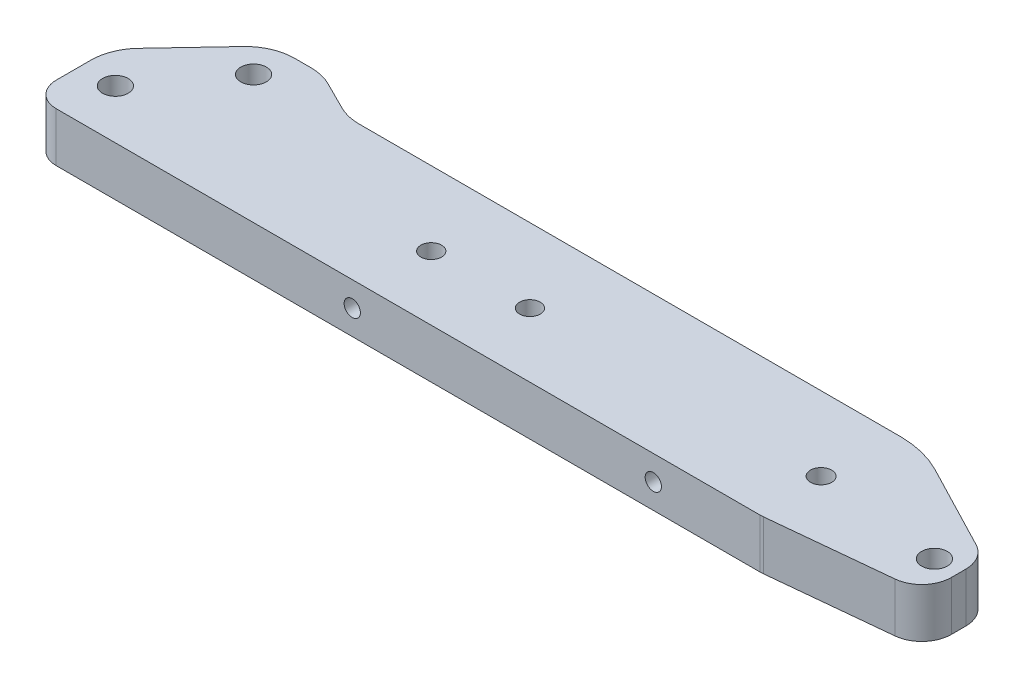
ISO-10303-21;
HEADER;
FILE_DESCRIPTION(('STEP AP214'),'2;1');
FILE_NAME('part.step','',(''),(''),'','','');
FILE_SCHEMA(('AUTOMOTIVE_DESIGN { 1 0 10303 214 1 1 1 1 }'));
ENDSEC;
DATA;
#1=APPLICATION_CONTEXT('core data for automotive mechanical design processes');
#2=APPLICATION_PROTOCOL_DEFINITION('international standard','automotive_design',2000,#1);
#3=PRODUCT_CONTEXT('',#1,'mechanical');
#4=PRODUCT('Part','Part','',(#3));
#5=PRODUCT_RELATED_PRODUCT_CATEGORY('part','',(#4));
#6=PRODUCT_DEFINITION_FORMATION('','',#4);
#7=PRODUCT_DEFINITION_CONTEXT('part definition',#1,'design');
#8=PRODUCT_DEFINITION('design','',#6,#7);
#9=PRODUCT_DEFINITION_SHAPE('','',#8);
#10=(LENGTH_UNIT() NAMED_UNIT(*) SI_UNIT(.MILLI.,.METRE.));
#11=(NAMED_UNIT(*) PLANE_ANGLE_UNIT() SI_UNIT($,.RADIAN.));
#12=(NAMED_UNIT(*) SI_UNIT($,.STERADIAN.) SOLID_ANGLE_UNIT());
#13=UNCERTAINTY_MEASURE_WITH_UNIT(LENGTH_MEASURE(1.E-05),#10,'distance_accuracy_value','');
#14=(GEOMETRIC_REPRESENTATION_CONTEXT(3) GLOBAL_UNCERTAINTY_ASSIGNED_CONTEXT((#13)) GLOBAL_UNIT_ASSIGNED_CONTEXT((#10,
#11,#12)) REPRESENTATION_CONTEXT('',''));
#15=CARTESIAN_POINT('',(0.,0.,0.));
#16=DIRECTION('',(0.,0.,1.));
#17=DIRECTION('',(1.,0.,0.));
#18=AXIS2_PLACEMENT_3D('',#15,#16,#17);
#19=CARTESIAN_POINT('',(0.,10.,0.));
#20=DIRECTION('',(0.,1.,0.));
#21=DIRECTION('',(0.,0.,1.));
#22=AXIS2_PLACEMENT_3D('',#19,#20,#21);
#23=PLANE('',#22);
#24=CARTESIAN_POINT('',(50.,10.,-13.));
#25=DIRECTION('',(0.,1.,0.));
#26=DIRECTION('',(0.,0.,1.));
#27=AXIS2_PLACEMENT_3D('',#24,#25,#26);
#28=CIRCLE('',#27,2.1);
#29=CARTESIAN_POINT('',(50.,10.,-10.9));
#30=VERTEX_POINT('',#29);
#31=EDGE_CURVE('E372',#30,#30,#28,.T.);
#32=ORIENTED_EDGE('',*,*,#31,.F.);
#33=EDGE_LOOP('',(#32));
#34=FACE_BOUND('',#33,.T.);
#35=CARTESIAN_POINT('',(129.,10.,-13.));
#36=DIRECTION('',(0.,1.,0.));
#37=DIRECTION('',(0.,0.,1.));
#38=AXIS2_PLACEMENT_3D('',#35,#36,#37);
#39=CIRCLE('',#38,2.15000000000002);
#40=CARTESIAN_POINT('',(129.,10.,-10.85));
#41=VERTEX_POINT('',#40);
#42=EDGE_CURVE('E360',#41,#41,#39,.T.);
#43=ORIENTED_EDGE('',*,*,#42,.F.);
#44=EDGE_LOOP('',(#43));
#45=FACE_BOUND('',#44,.T.);
#46=CARTESIAN_POINT('',(154.9653800056,10.,-10.));
#47=DIRECTION('',(0.,1.,0.));
#48=DIRECTION('',(0.,0.,1.));
#49=AXIS2_PLACEMENT_3D('',#46,#47,#48);
#50=CIRCLE('',#49,2.59999999999999);
#51=CARTESIAN_POINT('',(154.9653800056,10.,-7.40000000000001));
#52=VERTEX_POINT('',#51);
#53=EDGE_CURVE('E305',#52,#52,#50,.T.);
#54=ORIENTED_EDGE('',*,*,#53,.F.);
#55=EDGE_LOOP('',(#54));
#56=FACE_BOUND('',#55,.T.);
#57=DIRECTION('',(-0.894427190999916,0.,-0.447213595499958));
#58=VECTOR('',#57,1.);
#59=CARTESIAN_POINT('',(8.,10.,-33.));
#60=LINE('',#59,#58);
#61=CARTESIAN_POINT('',(15.8885438199983,10.,-29.0557280900008));
#62=VERTEX_POINT('',#61);
#63=CARTESIAN_POINT('',(10.1114561800017,10.,-31.9442719099992));
#64=VERTEX_POINT('',#63);
#65=EDGE_CURVE('E286',#62,#64,#60,.T.);
#66=ORIENTED_EDGE('',*,*,#65,.T.);
#67=CARTESIAN_POINT('',(5.6393202250021,10.,-23.));
#68=DIRECTION('',(0.,1.,0.));
#69=DIRECTION('',(0.,0.,1.));
#70=AXIS2_PLACEMENT_3D('',#67,#68,#69);
#71=CIRCLE('',#70,10.);
#72=CARTESIAN_POINT('',(5.6393202250021,10.,-33.));
#73=VERTEX_POINT('',#72);
#74=EDGE_CURVE('E52',#64,#73,#71,.T.);
#75=ORIENTED_EDGE('',*,*,#74,.T.);
#76=DIRECTION('',(-1.,0.,0.));
#77=VECTOR('',#76,1.);
#78=CARTESIAN_POINT('',(-2.,10.,-33.));
#79=LINE('',#78,#77);
#80=CARTESIAN_POINT('',(2.32072650579852,10.,-33.));
#81=VERTEX_POINT('',#80);
#82=EDGE_CURVE('E290',#73,#81,#79,.T.);
#83=ORIENTED_EDGE('',*,*,#82,.T.);
#84=CARTESIAN_POINT('',(2.32072650579852,10.,-23.));
#85=DIRECTION('',(0.,1.,0.));
#86=DIRECTION('',(0.,0.,1.));
#87=AXIS2_PLACEMENT_3D('',#84,#85,#86);
#88=CIRCLE('',#87,10.);
#89=CARTESIAN_POINT('',(-4.9612734211295,10.,-29.8536469900499));
#90=VERTEX_POINT('',#89);
#91=EDGE_CURVE('E242',#81,#90,#88,.T.);
#92=ORIENTED_EDGE('',*,*,#91,.T.);
#93=DIRECTION('',(-0.685364699004991,0.,0.728199992692803));
#94=VECTOR('',#93,1.);
#95=CARTESIAN_POINT('',(-18.,10.,-16.));
#96=LINE('',#95,#94);
#97=CARTESIAN_POINT('',(-15.281999926928,10.,-18.887875077639));
#98=VERTEX_POINT('',#97);
#99=EDGE_CURVE('E292',#90,#98,#96,.T.);
#100=ORIENTED_EDGE('',*,*,#99,.T.);
#101=CARTESIAN_POINT('',(-8.,10.,-12.0342280875891));
#102=DIRECTION('',(0.,1.,0.));
#103=DIRECTION('',(0.,0.,1.));
#104=AXIS2_PLACEMENT_3D('',#101,#102,#103);
#105=CIRCLE('',#104,10.);
#106=CARTESIAN_POINT('',(-18.,10.,-12.0342280875891));
#107=VERTEX_POINT('',#106);
#108=EDGE_CURVE('E240',#98,#107,#105,.T.);
#109=ORIENTED_EDGE('',*,*,#108,.T.);
#110=DIRECTION('',(0.,0.,1.));
#111=VECTOR('',#110,1.);
#112=CARTESIAN_POINT('',(-18.,10.,-16.));
#113=LINE('',#112,#111);
#114=CARTESIAN_POINT('',(-18.,10.,-5.));
#115=VERTEX_POINT('',#114);
#116=EDGE_CURVE('E183',#107,#115,#113,.T.);
#117=ORIENTED_EDGE('',*,*,#116,.T.);
#118=CARTESIAN_POINT('',(-13.,10.,-5.));
#119=DIRECTION('',(0.,1.,0.));
#120=DIRECTION('',(0.,0.,1.));
#121=AXIS2_PLACEMENT_3D('',#118,#119,#120);
#122=CIRCLE('',#121,5.);
#123=CARTESIAN_POINT('',(-13.,10.,0.));
#124=VERTEX_POINT('',#123);
#125=EDGE_CURVE('E199',#115,#124,#122,.T.);
#126=ORIENTED_EDGE('',*,*,#125,.T.);
#127=DIRECTION('',(1.,0.,0.));
#128=VECTOR('',#127,1.);
#129=CARTESIAN_POINT('',(0.,10.,0.));
#130=LINE('',#129,#128);
#131=CARTESIAN_POINT('',(129.666126278875,10.,0.));
#132=VERTEX_POINT('',#131);
#133=EDGE_CURVE('E182',#124,#132,#130,.T.);
#134=ORIENTED_EDGE('',*,*,#133,.T.);
#135=CARTESIAN_POINT('',(129.666126278875,10.,-6.));
#136=DIRECTION('',(0.,1.,0.));
#137=DIRECTION('',(0.,0.,1.));
#138=AXIS2_PLACEMENT_3D('',#135,#136,#137);
#139=CIRCLE('',#138,6.);
#140=CARTESIAN_POINT('',(130.263148593001,10.,-0.0297768587400656));
#141=VERTEX_POINT('',#140);
#142=EDGE_CURVE('E217',#132,#141,#139,.T.);
#143=ORIENTED_EDGE('',*,*,#142,.T.);
#144=DIRECTION('',(0.995037190209989,0.,-0.0995037190209989));
#145=VECTOR('',#144,1.);
#146=CARTESIAN_POINT('',(159.9653800056,10.,-3.));
#147=LINE('',#146,#145);
#148=CARTESIAN_POINT('',(154.562402319726,10.,-2.4597022314126));
#149=VERTEX_POINT('',#148);
#150=EDGE_CURVE('E192',#141,#149,#147,.T.);
#151=ORIENTED_EDGE('',*,*,#150,.T.);
#152=CARTESIAN_POINT('',(153.9653800056,10.,-8.42992537267253));
#153=DIRECTION('',(0.,1.,0.));
#154=DIRECTION('',(0.,0.,1.));
#155=AXIS2_PLACEMENT_3D('',#152,#153,#154);
#156=CIRCLE('',#155,6.);
#157=CARTESIAN_POINT('',(159.9653800056,10.,-8.42992537267253));
#158=VERTEX_POINT('',#157);
#159=EDGE_CURVE('E215',#149,#158,#156,.T.);
#160=ORIENTED_EDGE('',*,*,#159,.T.);
#161=DIRECTION('',(0.,0.,-1.));
#162=VECTOR('',#161,1.);
#163=CARTESIAN_POINT('',(159.9653800056,10.,-3.));
#164=LINE('',#163,#162);
#165=CARTESIAN_POINT('',(159.9653800056,10.,-11.3572786542694));
#166=VERTEX_POINT('',#165);
#167=EDGE_CURVE('E345',#158,#166,#164,.T.);
#168=ORIENTED_EDGE('',*,*,#167,.T.);
#169=CARTESIAN_POINT('',(153.9653800056,10.,-11.3572786542694));
#170=DIRECTION('',(0.,1.,0.));
#171=DIRECTION('',(0.,0.,1.));
#172=AXIS2_PLACEMENT_3D('',#169,#170,#171);
#173=CIRCLE('',#172,6.);
#174=CARTESIAN_POINT('',(156.733496425452,10.,-16.680579461677));
#175=VERTEX_POINT('',#174);
#176=EDGE_CURVE('E213',#166,#175,#173,.T.);
#177=ORIENTED_EDGE('',*,*,#176,.T.);
#178=DIRECTION('',(-0.887216801234595,0.,-0.46135273664199));
#179=VECTOR('',#178,1.);
#180=CARTESIAN_POINT('',(159.9653800056,10.,-15.));
#181=LINE('',#180,#179);
#182=CARTESIAN_POINT('',(139.303195342731,10.,-25.7443360246919));
#183=VERTEX_POINT('',#182);
#184=EDGE_CURVE('E294',#175,#183,#181,.T.);
#185=ORIENTED_EDGE('',*,*,#184,.T.);
#186=CARTESIAN_POINT('',(130.076140609891,10.,-8.));
#187=DIRECTION('',(0.,1.,0.));
#188=DIRECTION('',(0.,0.,1.));
#189=AXIS2_PLACEMENT_3D('',#186,#187,#188);
#190=CIRCLE('',#189,20.);
#191=CARTESIAN_POINT('',(130.076140609891,10.,-28.));
#192=VERTEX_POINT('',#191);
#193=EDGE_CURVE('E254',#183,#192,#190,.T.);
#194=ORIENTED_EDGE('',*,*,#193,.T.);
#195=DIRECTION('',(-1.,0.,0.));
#196=VECTOR('',#195,1.);
#197=CARTESIAN_POINT('',(18.,10.,-28.));
#198=LINE('',#197,#196);
#199=CARTESIAN_POINT('',(20.3606797749979,10.,-28.));
#200=VERTEX_POINT('',#199);
#201=EDGE_CURVE('E287',#192,#200,#198,.T.);
#202=ORIENTED_EDGE('',*,*,#201,.T.);
#203=CARTESIAN_POINT('',(20.3606797749979,10.,-38.));
#204=DIRECTION('',(0.,1.,0.));
#205=DIRECTION('',(0.,0.,1.));
#206=AXIS2_PLACEMENT_3D('',#203,#204,#205);
#207=CIRCLE('',#206,10.);
#208=EDGE_CURVE('E11',#200,#62,#207,.F.);
#209=ORIENTED_EDGE('',*,*,#208,.T.);
#210=EDGE_LOOP('',(#66,#75,#83,#92,#100,#109,#117,#126,#134,#143,#151,#160,#168,#177,#185,#194,
#202,#209));
#211=FACE_BOUND('',#210,.T.);
#212=CARTESIAN_POINT('',(-11.,10.,-10.));
#213=DIRECTION('',(0.,1.,0.));
#214=DIRECTION('',(0.,0.,1.));
#215=AXIS2_PLACEMENT_3D('',#212,#213,#214);
#216=CIRCLE('',#215,2.6);
#217=CARTESIAN_POINT('',(-11.,10.,-7.4));
#218=VERTEX_POINT('',#217);
#219=EDGE_CURVE('E354',#218,#218,#216,.T.);
#220=ORIENTED_EDGE('',*,*,#219,.F.);
#221=EDGE_LOOP('',(#220));
#222=FACE_BOUND('',#221,.T.);
#223=CARTESIAN_POINT('',(0.999999999999992,10.,-26.));
#224=DIRECTION('',(0.,1.,0.));
#225=DIRECTION('',(0.,0.,1.));
#226=AXIS2_PLACEMENT_3D('',#223,#224,#225);
#227=CIRCLE('',#226,2.6);
#228=CARTESIAN_POINT('',(0.999999999999992,10.,-23.4));
#229=VERTEX_POINT('',#228);
#230=EDGE_CURVE('E366',#229,#229,#227,.T.);
#231=ORIENTED_EDGE('',*,*,#230,.F.);
#232=EDGE_LOOP('',(#231));
#233=FACE_BOUND('',#232,.T.);
#234=CARTESIAN_POINT('',(70.,10.,-13.));
#235=DIRECTION('',(0.,1.,0.));
#236=DIRECTION('',(0.,0.,1.));
#237=AXIS2_PLACEMENT_3D('',#234,#235,#236);
#238=CIRCLE('',#237,2.1);
#239=CARTESIAN_POINT('',(70.,10.,-10.9));
#240=VERTEX_POINT('',#239);
#241=EDGE_CURVE('E378',#240,#240,#238,.T.);
#242=ORIENTED_EDGE('',*,*,#241,.F.);
#243=EDGE_LOOP('',(#242));
#244=FACE_BOUND('',#243,.T.);
#245=ADVANCED_FACE('F37',(#34,#45,#56,#211,#222,#233,#244),#23,.T.);
#246=CARTESIAN_POINT('',(0.,0.,0.));
#247=DIRECTION('',(0.,1.,0.));
#248=DIRECTION('',(0.,0.,1.));
#249=AXIS2_PLACEMENT_3D('',#246,#247,#248);
#250=PLANE('',#249);
#251=DIRECTION('',(-1.,0.,0.));
#252=VECTOR('',#251,1.);
#253=CARTESIAN_POINT('',(-2.,0.,-33.));
#254=LINE('',#253,#252);
#255=CARTESIAN_POINT('',(5.6393202250021,0.,-33.));
#256=VERTEX_POINT('',#255);
#257=CARTESIAN_POINT('',(2.32072650579852,0.,-33.));
#258=VERTEX_POINT('',#257);
#259=EDGE_CURVE('E311',#256,#258,#254,.T.);
#260=ORIENTED_EDGE('',*,*,#259,.F.);
#261=CARTESIAN_POINT('',(5.6393202250021,0.,-23.));
#262=DIRECTION('',(0.,1.,0.));
#263=DIRECTION('',(0.,0.,1.));
#264=AXIS2_PLACEMENT_3D('',#261,#262,#263);
#265=CIRCLE('',#264,10.);
#266=CARTESIAN_POINT('',(10.1114561800017,0.,-31.9442719099992));
#267=VERTEX_POINT('',#266);
#268=EDGE_CURVE('E60',#256,#267,#265,.F.);
#269=ORIENTED_EDGE('',*,*,#268,.T.);
#270=DIRECTION('',(-0.894427190999916,0.,-0.447213595499958));
#271=VECTOR('',#270,1.);
#272=CARTESIAN_POINT('',(8.,0.,-33.));
#273=LINE('',#272,#271);
#274=CARTESIAN_POINT('',(15.8885438199983,0.,-29.0557280900008));
#275=VERTEX_POINT('',#274);
#276=EDGE_CURVE('E271',#275,#267,#273,.T.);
#277=ORIENTED_EDGE('',*,*,#276,.F.);
#278=CARTESIAN_POINT('',(20.3606797749979,0.,-38.));
#279=DIRECTION('',(0.,1.,0.));
#280=DIRECTION('',(0.,0.,1.));
#281=AXIS2_PLACEMENT_3D('',#278,#279,#280);
#282=CIRCLE('',#281,10.);
#283=CARTESIAN_POINT('',(20.3606797749979,0.,-28.));
#284=VERTEX_POINT('',#283);
#285=EDGE_CURVE('E45',#275,#284,#282,.T.);
#286=ORIENTED_EDGE('',*,*,#285,.T.);
#287=DIRECTION('',(-1.,0.,0.));
#288=VECTOR('',#287,1.);
#289=CARTESIAN_POINT('',(18.,0.,-28.));
#290=LINE('',#289,#288);
#291=CARTESIAN_POINT('',(130.076140609891,0.,-28.));
#292=VERTEX_POINT('',#291);
#293=EDGE_CURVE('E269',#292,#284,#290,.T.);
#294=ORIENTED_EDGE('',*,*,#293,.F.);
#295=CARTESIAN_POINT('',(130.076140609891,0.,-8.));
#296=DIRECTION('',(0.,1.,0.));
#297=DIRECTION('',(0.,0.,1.));
#298=AXIS2_PLACEMENT_3D('',#295,#296,#297);
#299=CIRCLE('',#298,20.);
#300=CARTESIAN_POINT('',(139.303195342731,0.,-25.7443360246919));
#301=VERTEX_POINT('',#300);
#302=EDGE_CURVE('E250',#292,#301,#299,.F.);
#303=ORIENTED_EDGE('',*,*,#302,.T.);
#304=DIRECTION('',(-0.887216801234595,0.,-0.46135273664199));
#305=VECTOR('',#304,1.);
#306=CARTESIAN_POINT('',(159.9653800056,0.,-15.));
#307=LINE('',#306,#305);
#308=CARTESIAN_POINT('',(156.733496425452,0.,-16.680579461677));
#309=VERTEX_POINT('',#308);
#310=EDGE_CURVE('E280',#309,#301,#307,.T.);
#311=ORIENTED_EDGE('',*,*,#310,.F.);
#312=CARTESIAN_POINT('',(153.9653800056,0.,-11.3572786542694));
#313=DIRECTION('',(0.,1.,0.));
#314=DIRECTION('',(0.,0.,1.));
#315=AXIS2_PLACEMENT_3D('',#312,#313,#314);
#316=CIRCLE('',#315,6.);
#317=CARTESIAN_POINT('',(159.9653800056,0.,-11.3572786542694));
#318=VERTEX_POINT('',#317);
#319=EDGE_CURVE('E206',#309,#318,#316,.F.);
#320=ORIENTED_EDGE('',*,*,#319,.T.);
#321=DIRECTION('',(0.,0.,-1.));
#322=VECTOR('',#321,1.);
#323=CARTESIAN_POINT('',(159.9653800056,0.,-3.));
#324=LINE('',#323,#322);
#325=CARTESIAN_POINT('',(159.9653800056,0.,-8.42992537267253));
#326=VERTEX_POINT('',#325);
#327=EDGE_CURVE('E304',#326,#318,#324,.T.);
#328=ORIENTED_EDGE('',*,*,#327,.F.);
#329=CARTESIAN_POINT('',(153.9653800056,0.,-8.42992537267253));
#330=DIRECTION('',(0.,1.,0.));
#331=DIRECTION('',(0.,0.,1.));
#332=AXIS2_PLACEMENT_3D('',#329,#330,#331);
#333=CIRCLE('',#332,6.);
#334=CARTESIAN_POINT('',(154.562402319726,0.,-2.4597022314126));
#335=VERTEX_POINT('',#334);
#336=EDGE_CURVE('E208',#326,#335,#333,.F.);
#337=ORIENTED_EDGE('',*,*,#336,.T.);
#338=DIRECTION('',(0.995037190209989,0.,-0.0995037190209989));
#339=VECTOR('',#338,1.);
#340=CARTESIAN_POINT('',(159.9653800056,0.,-3.));
#341=LINE('',#340,#339);
#342=CARTESIAN_POINT('',(130.263148593001,0.,-0.0297768587400656));
#343=VERTEX_POINT('',#342);
#344=EDGE_CURVE('E301',#343,#335,#341,.T.);
#345=ORIENTED_EDGE('',*,*,#344,.F.);
#346=CARTESIAN_POINT('',(129.666126278875,0.,-6.));
#347=DIRECTION('',(0.,1.,0.));
#348=DIRECTION('',(0.,0.,1.));
#349=AXIS2_PLACEMENT_3D('',#346,#347,#348);
#350=CIRCLE('',#349,6.);
#351=CARTESIAN_POINT('',(129.666126278875,0.,0.));
#352=VERTEX_POINT('',#351);
#353=EDGE_CURVE('E189',#343,#352,#350,.F.);
#354=ORIENTED_EDGE('',*,*,#353,.T.);
#355=DIRECTION('',(1.,0.,0.));
#356=VECTOR('',#355,1.);
#357=CARTESIAN_POINT('',(-18.,0.,0.));
#358=LINE('',#357,#356);
#359=CARTESIAN_POINT('',(-13.,0.,0.));
#360=VERTEX_POINT('',#359);
#361=EDGE_CURVE('E179',#360,#352,#358,.T.);
#362=ORIENTED_EDGE('',*,*,#361,.F.);
#363=CARTESIAN_POINT('',(-13.,0.,-5.));
#364=DIRECTION('',(0.,1.,0.));
#365=DIRECTION('',(0.,0.,1.));
#366=AXIS2_PLACEMENT_3D('',#363,#364,#365);
#367=CIRCLE('',#366,5.);
#368=CARTESIAN_POINT('',(-18.,0.,-5.));
#369=VERTEX_POINT('',#368);
#370=EDGE_CURVE('E164',#360,#369,#367,.F.);
#371=ORIENTED_EDGE('',*,*,#370,.T.);
#372=DIRECTION('',(0.,0.,1.));
#373=VECTOR('',#372,1.);
#374=CARTESIAN_POINT('',(-18.,0.,-16.));
#375=LINE('',#374,#373);
#376=CARTESIAN_POINT('',(-18.,0.,-12.0342280875891));
#377=VERTEX_POINT('',#376);
#378=EDGE_CURVE('E190',#377,#369,#375,.T.);
#379=ORIENTED_EDGE('',*,*,#378,.F.);
#380=CARTESIAN_POINT('',(-8.,0.,-12.0342280875891));
#381=DIRECTION('',(0.,1.,0.));
#382=DIRECTION('',(0.,0.,1.));
#383=AXIS2_PLACEMENT_3D('',#380,#381,#382);
#384=CIRCLE('',#383,10.);
#385=CARTESIAN_POINT('',(-15.281999926928,0.,-18.887875077639));
#386=VERTEX_POINT('',#385);
#387=EDGE_CURVE('E232',#377,#386,#384,.F.);
#388=ORIENTED_EDGE('',*,*,#387,.T.);
#389=DIRECTION('',(-0.685364699004991,0.,0.728199992692803));
#390=VECTOR('',#389,1.);
#391=CARTESIAN_POINT('',(-18.,0.,-16.));
#392=LINE('',#391,#390);
#393=CARTESIAN_POINT('',(-4.9612734211295,0.,-29.8536469900499));
#394=VERTEX_POINT('',#393);
#395=EDGE_CURVE('E194',#394,#386,#392,.T.);
#396=ORIENTED_EDGE('',*,*,#395,.F.);
#397=CARTESIAN_POINT('',(2.32072650579852,0.,-23.));
#398=DIRECTION('',(0.,1.,0.));
#399=DIRECTION('',(0.,0.,1.));
#400=AXIS2_PLACEMENT_3D('',#397,#398,#399);
#401=CIRCLE('',#400,10.);
#402=EDGE_CURVE('E234',#394,#258,#401,.F.);
#403=ORIENTED_EDGE('',*,*,#402,.T.);
#404=EDGE_LOOP('',(#260,#269,#277,#286,#294,#303,#311,#320,#328,#337,#345,#354,#362,#371,#379,
#388,#396,#403));
#405=FACE_BOUND('',#404,.T.);
#406=CARTESIAN_POINT('',(154.9653800056,0.,-10.));
#407=DIRECTION('',(0.,1.,0.));
#408=DIRECTION('',(0.,0.,1.));
#409=AXIS2_PLACEMENT_3D('',#406,#407,#408);
#410=CIRCLE('',#409,2.59999999999999);
#411=CARTESIAN_POINT('',(154.9653800056,0.,-7.40000000000001));
#412=VERTEX_POINT('',#411);
#413=EDGE_CURVE('E351',#412,#412,#410,.T.);
#414=ORIENTED_EDGE('',*,*,#413,.T.);
#415=EDGE_LOOP('',(#414));
#416=FACE_BOUND('',#415,.T.);
#417=CARTESIAN_POINT('',(-11.,0.,-10.));
#418=DIRECTION('',(0.,1.,0.));
#419=DIRECTION('',(0.,0.,1.));
#420=AXIS2_PLACEMENT_3D('',#417,#418,#419);
#421=CIRCLE('',#420,2.6);
#422=CARTESIAN_POINT('',(-11.,0.,-7.4));
#423=VERTEX_POINT('',#422);
#424=EDGE_CURVE('E357',#423,#423,#421,.T.);
#425=ORIENTED_EDGE('',*,*,#424,.T.);
#426=EDGE_LOOP('',(#425));
#427=FACE_BOUND('',#426,.T.);
#428=CARTESIAN_POINT('',(129.,0.,-13.));
#429=DIRECTION('',(0.,1.,0.));
#430=DIRECTION('',(0.,0.,1.));
#431=AXIS2_PLACEMENT_3D('',#428,#429,#430);
#432=CIRCLE('',#431,2.15000000000002);
#433=CARTESIAN_POINT('',(129.,0.,-10.85));
#434=VERTEX_POINT('',#433);
#435=EDGE_CURVE('E363',#434,#434,#432,.T.);
#436=ORIENTED_EDGE('',*,*,#435,.T.);
#437=EDGE_LOOP('',(#436));
#438=FACE_BOUND('',#437,.T.);
#439=CARTESIAN_POINT('',(0.999999999999992,0.,-26.));
#440=DIRECTION('',(0.,1.,0.));
#441=DIRECTION('',(0.,0.,1.));
#442=AXIS2_PLACEMENT_3D('',#439,#440,#441);
#443=CIRCLE('',#442,2.6);
#444=CARTESIAN_POINT('',(0.999999999999992,0.,-23.4));
#445=VERTEX_POINT('',#444);
#446=EDGE_CURVE('E369',#445,#445,#443,.T.);
#447=ORIENTED_EDGE('',*,*,#446,.T.);
#448=EDGE_LOOP('',(#447));
#449=FACE_BOUND('',#448,.T.);
#450=CARTESIAN_POINT('',(50.,0.,-13.));
#451=DIRECTION('',(0.,1.,0.));
#452=DIRECTION('',(0.,0.,1.));
#453=AXIS2_PLACEMENT_3D('',#450,#451,#452);
#454=CIRCLE('',#453,2.1);
#455=CARTESIAN_POINT('',(50.,0.,-10.9));
#456=VERTEX_POINT('',#455);
#457=EDGE_CURVE('E375',#456,#456,#454,.T.);
#458=ORIENTED_EDGE('',*,*,#457,.T.);
#459=EDGE_LOOP('',(#458));
#460=FACE_BOUND('',#459,.T.);
#461=CARTESIAN_POINT('',(70.,0.,-13.));
#462=DIRECTION('',(0.,1.,0.));
#463=DIRECTION('',(0.,0.,1.));
#464=AXIS2_PLACEMENT_3D('',#461,#462,#463);
#465=CIRCLE('',#464,2.1);
#466=CARTESIAN_POINT('',(70.,0.,-10.9));
#467=VERTEX_POINT('',#466);
#468=EDGE_CURVE('E381',#467,#467,#465,.T.);
#469=ORIENTED_EDGE('',*,*,#468,.T.);
#470=EDGE_LOOP('',(#469));
#471=FACE_BOUND('',#470,.T.);
#472=ADVANCED_FACE('F186',(#405,#416,#427,#438,#449,#460,#471),#250,.F.);
#473=CARTESIAN_POINT('',(159.9653800056,10.,-3.));
#474=DIRECTION('',(-0.0995037190209989,0.,-0.995037190209989));
#475=DIRECTION('',(-0.995037190209989,0.,0.099503719020999));
#476=AXIS2_PLACEMENT_3D('',#473,#474,#475);
#477=PLANE('',#476);
#478=ORIENTED_EDGE('',*,*,#150,.F.);
#479=DIRECTION('',(0.,-1.,0.));
#480=VECTOR('',#479,1.);
#481=CARTESIAN_POINT('',(130.263148593001,10.,-0.0297768587400652));
#482=LINE('',#481,#480);
#483=EDGE_CURVE('E203',#141,#343,#482,.T.);
#484=ORIENTED_EDGE('',*,*,#483,.T.);
#485=ORIENTED_EDGE('',*,*,#344,.T.);
#486=DIRECTION('',(0.,-1.,0.));
#487=VECTOR('',#486,1.);
#488=CARTESIAN_POINT('',(154.562402319726,10.,-2.4597022314126));
#489=LINE('',#488,#487);
#490=EDGE_CURVE('E201',#335,#149,#489,.F.);
#491=ORIENTED_EDGE('',*,*,#490,.T.);
#492=EDGE_LOOP('',(#478,#484,#485,#491));
#493=FACE_BOUND('',#492,.T.);
#494=ADVANCED_FACE('F333',(#493),#477,.F.);
#495=CARTESIAN_POINT('',(159.9653800056,10.,-3.));
#496=DIRECTION('',(-1.,0.,0.));
#497=DIRECTION('',(0.,0.,1.));
#498=AXIS2_PLACEMENT_3D('',#495,#496,#497);
#499=PLANE('',#498);
#500=ORIENTED_EDGE('',*,*,#167,.F.);
#501=DIRECTION('',(0.,-1.,0.));
#502=VECTOR('',#501,1.);
#503=CARTESIAN_POINT('',(159.9653800056,10.,-8.42992537267253));
#504=LINE('',#503,#502);
#505=EDGE_CURVE('E221',#158,#326,#504,.T.);
#506=ORIENTED_EDGE('',*,*,#505,.T.);
#507=ORIENTED_EDGE('',*,*,#327,.T.);
#508=DIRECTION('',(0.,-1.,0.));
#509=VECTOR('',#508,1.);
#510=CARTESIAN_POINT('',(159.9653800056,10.,-11.3572786542694));
#511=LINE('',#510,#509);
#512=EDGE_CURVE('E219',#318,#166,#511,.F.);
#513=ORIENTED_EDGE('',*,*,#512,.T.);
#514=EDGE_LOOP('',(#500,#506,#507,#513));
#515=FACE_BOUND('',#514,.T.);
#516=ADVANCED_FACE('F342',(#515),#499,.F.);
#517=CARTESIAN_POINT('',(159.9653800056,10.,-15.));
#518=DIRECTION('',(-0.46135273664199,0.,0.887216801234595));
#519=DIRECTION('',(0.887216801234595,0.,0.46135273664199));
#520=AXIS2_PLACEMENT_3D('',#517,#518,#519);
#521=PLANE('',#520);
#522=ORIENTED_EDGE('',*,*,#310,.T.);
#523=DIRECTION('',(0.,-1.,0.));
#524=VECTOR('',#523,1.);
#525=CARTESIAN_POINT('',(139.303195342731,10.,-25.7443360246919));
#526=LINE('',#525,#524);
#527=EDGE_CURVE('E252',#301,#183,#526,.F.);
#528=ORIENTED_EDGE('',*,*,#527,.T.);
#529=ORIENTED_EDGE('',*,*,#184,.F.);
#530=DIRECTION('',(0.,-1.,0.));
#531=VECTOR('',#530,1.);
#532=CARTESIAN_POINT('',(156.733496425452,10.,-16.680579461677));
#533=LINE('',#532,#531);
#534=EDGE_CURVE('E224',#175,#309,#533,.T.);
#535=ORIENTED_EDGE('',*,*,#534,.T.);
#536=EDGE_LOOP('',(#522,#528,#529,#535));
#537=FACE_BOUND('',#536,.T.);
#538=ADVANCED_FACE('F449',(#537),#521,.F.);
#539=CARTESIAN_POINT('',(18.,10.,-28.));
#540=DIRECTION('',(0.,0.,1.));
#541=DIRECTION('',(1.,0.,0.));
#542=AXIS2_PLACEMENT_3D('',#539,#540,#541);
#543=PLANE('',#542);
#544=ORIENTED_EDGE('',*,*,#293,.T.);
#545=DIRECTION('',(0.,-1.,0.));
#546=VECTOR('',#545,1.);
#547=CARTESIAN_POINT('',(20.3606797749979,10.,-28.));
#548=LINE('',#547,#546);
#549=EDGE_CURVE('E261',#284,#200,#548,.F.);
#550=ORIENTED_EDGE('',*,*,#549,.T.);
#551=ORIENTED_EDGE('',*,*,#201,.F.);
#552=DIRECTION('',(0.,-1.,0.));
#553=VECTOR('',#552,1.);
#554=CARTESIAN_POINT('',(130.076140609891,10.,-28.));
#555=LINE('',#554,#553);
#556=EDGE_CURVE('E247',#192,#292,#555,.T.);
#557=ORIENTED_EDGE('',*,*,#556,.T.);
#558=EDGE_LOOP('',(#544,#550,#551,#557));
#559=FACE_BOUND('',#558,.T.);
#560=ADVANCED_FACE('F276',(#559),#543,.F.);
#561=CARTESIAN_POINT('',(8.,10.,-33.));
#562=DIRECTION('',(-0.447213595499958,0.,0.894427190999916));
#563=DIRECTION('',(0.894427190999916,0.,0.447213595499958));
#564=AXIS2_PLACEMENT_3D('',#561,#562,#563);
#565=PLANE('',#564);
#566=ORIENTED_EDGE('',*,*,#65,.F.);
#567=DIRECTION('',(0.,-1.,0.));
#568=VECTOR('',#567,1.);
#569=CARTESIAN_POINT('',(15.8885438199983,0.,-29.0557280900008));
#570=LINE('',#569,#568);
#571=EDGE_CURVE('E258',#62,#275,#570,.T.);
#572=ORIENTED_EDGE('',*,*,#571,.T.);
#573=ORIENTED_EDGE('',*,*,#276,.T.);
#574=DIRECTION('',(0.,-1.,0.));
#575=VECTOR('',#574,1.);
#576=CARTESIAN_POINT('',(10.1114561800017,10.,-31.9442719099992));
#577=LINE('',#576,#575);
#578=EDGE_CURVE('E256',#267,#64,#577,.F.);
#579=ORIENTED_EDGE('',*,*,#578,.T.);
#580=EDGE_LOOP('',(#566,#572,#573,#579));
#581=FACE_BOUND('',#580,.T.);
#582=ADVANCED_FACE('F289',(#581),#565,.F.);
#583=CARTESIAN_POINT('',(-2.,10.,-33.));
#584=DIRECTION('',(0.,0.,1.));
#585=DIRECTION('',(1.,0.,0.));
#586=AXIS2_PLACEMENT_3D('',#583,#584,#585);
#587=PLANE('',#586);
#588=ORIENTED_EDGE('',*,*,#82,.F.);
#589=DIRECTION('',(0.,-1.,0.));
#590=VECTOR('',#589,1.);
#591=CARTESIAN_POINT('',(5.6393202250021,10.,-33.));
#592=LINE('',#591,#590);
#593=EDGE_CURVE('E263',#73,#256,#592,.T.);
#594=ORIENTED_EDGE('',*,*,#593,.T.);
#595=ORIENTED_EDGE('',*,*,#259,.T.);
#596=DIRECTION('',(0.,-1.,0.));
#597=VECTOR('',#596,1.);
#598=CARTESIAN_POINT('',(2.32072650579852,10.,-33.));
#599=LINE('',#598,#597);
#600=EDGE_CURVE('E237',#258,#81,#599,.F.);
#601=ORIENTED_EDGE('',*,*,#600,.T.);
#602=EDGE_LOOP('',(#588,#594,#595,#601));
#603=FACE_BOUND('',#602,.T.);
#604=ADVANCED_FACE('F441',(#603),#587,.F.);
#605=CARTESIAN_POINT('',(-18.,10.,-16.));
#606=DIRECTION('',(0.728199992692803,0.,0.685364699004991));
#607=DIRECTION('',(0.685364699004991,0.,-0.728199992692803));
#608=AXIS2_PLACEMENT_3D('',#605,#606,#607);
#609=PLANE('',#608);
#610=ORIENTED_EDGE('',*,*,#99,.F.);
#611=DIRECTION('',(0.,-1.,0.));
#612=VECTOR('',#611,1.);
#613=CARTESIAN_POINT('',(-4.9612734211295,10.,-29.8536469900499));
#614=LINE('',#613,#612);
#615=EDGE_CURVE('E229',#90,#394,#614,.T.);
#616=ORIENTED_EDGE('',*,*,#615,.T.);
#617=ORIENTED_EDGE('',*,*,#395,.T.);
#618=DIRECTION('',(0.,-1.,0.));
#619=VECTOR('',#618,1.);
#620=CARTESIAN_POINT('',(-15.281999926928,10.,-18.887875077639));
#621=LINE('',#620,#619);
#622=EDGE_CURVE('E227',#386,#98,#621,.F.);
#623=ORIENTED_EDGE('',*,*,#622,.T.);
#624=EDGE_LOOP('',(#610,#616,#617,#623));
#625=FACE_BOUND('',#624,.T.);
#626=ADVANCED_FACE('F317',(#625),#609,.F.);
#627=CARTESIAN_POINT('',(-18.,10.,-16.));
#628=DIRECTION('',(1.,0.,0.));
#629=DIRECTION('',(0.,0.,-1.));
#630=AXIS2_PLACEMENT_3D('',#627,#628,#629);
#631=PLANE('',#630);
#632=ORIENTED_EDGE('',*,*,#116,.F.);
#633=DIRECTION('',(0.,-1.,0.));
#634=VECTOR('',#633,1.);
#635=CARTESIAN_POINT('',(-18.,10.,-12.0342280875891));
#636=LINE('',#635,#634);
#637=EDGE_CURVE('E244',#107,#377,#636,.T.);
#638=ORIENTED_EDGE('',*,*,#637,.T.);
#639=ORIENTED_EDGE('',*,*,#378,.T.);
#640=DIRECTION('',(0.,-1.,0.));
#641=VECTOR('',#640,1.);
#642=CARTESIAN_POINT('',(-18.,10.,-5.));
#643=LINE('',#642,#641);
#644=EDGE_CURVE('E170',#369,#115,#643,.F.);
#645=ORIENTED_EDGE('',*,*,#644,.T.);
#646=EDGE_LOOP('',(#632,#638,#639,#645));
#647=FACE_BOUND('',#646,.T.);
#648=ADVANCED_FACE('F325',(#647),#631,.F.);
#649=CARTESIAN_POINT('',(-18.,10.,0.));
#650=DIRECTION('',(0.,0.,-1.));
#651=DIRECTION('',(-1.,0.,0.));
#652=AXIS2_PLACEMENT_3D('',#649,#650,#651);
#653=PLANE('',#652);
#654=CARTESIAN_POINT('',(47.,5.,0.));
#655=DIRECTION('',(0.,0.,1.));
#656=DIRECTION('',(1.,0.,0.));
#657=AXIS2_PLACEMENT_3D('',#654,#655,#656);
#658=CIRCLE('',#657,1.65);
#659=CARTESIAN_POINT('',(48.65,5.,0.));
#660=VERTEX_POINT('',#659);
#661=EDGE_CURVE('E393',#660,#660,#658,.T.);
#662=ORIENTED_EDGE('',*,*,#661,.F.);
#663=EDGE_LOOP('',(#662));
#664=FACE_BOUND('',#663,.T.);
#665=CARTESIAN_POINT('',(108.,5.,0.));
#666=DIRECTION('',(0.,0.,1.));
#667=DIRECTION('',(1.,0.,0.));
#668=AXIS2_PLACEMENT_3D('',#665,#666,#667);
#669=CIRCLE('',#668,1.65);
#670=CARTESIAN_POINT('',(109.65,5.,0.));
#671=VERTEX_POINT('',#670);
#672=EDGE_CURVE('E390',#671,#671,#669,.T.);
#673=ORIENTED_EDGE('',*,*,#672,.F.);
#674=EDGE_LOOP('',(#673));
#675=FACE_BOUND('',#674,.T.);
#676=ORIENTED_EDGE('',*,*,#361,.T.);
#677=DIRECTION('',(0.,-1.,0.));
#678=VECTOR('',#677,1.);
#679=CARTESIAN_POINT('',(129.666126278875,10.,0.));
#680=LINE('',#679,#678);
#681=EDGE_CURVE('E211',#352,#132,#680,.F.);
#682=ORIENTED_EDGE('',*,*,#681,.T.);
#683=ORIENTED_EDGE('',*,*,#133,.F.);
#684=DIRECTION('',(0.,-1.,0.));
#685=VECTOR('',#684,1.);
#686=CARTESIAN_POINT('',(-13.,10.,0.));
#687=LINE('',#686,#685);
#688=EDGE_CURVE('E168',#124,#360,#687,.T.);
#689=ORIENTED_EDGE('',*,*,#688,.T.);
#690=EDGE_LOOP('',(#676,#682,#683,#689));
#691=FACE_BOUND('',#690,.T.);
#692=ADVANCED_FACE('F178',(#664,#675,#691),#653,.F.);
#693=CARTESIAN_POINT('',(154.9653800056,10.,-10.));
#694=DIRECTION('',(0.,-1.,0.));
#695=DIRECTION('',(0.,0.,-1.));
#696=AXIS2_PLACEMENT_3D('',#693,#694,#695);
#697=CYLINDRICAL_SURFACE('',#696,2.59999999999999);
#698=ORIENTED_EDGE('',*,*,#53,.T.);
#699=EDGE_LOOP('',(#698));
#700=FACE_BOUND('',#699,.T.);
#701=ORIENTED_EDGE('',*,*,#413,.F.);
#702=EDGE_LOOP('',(#701));
#703=FACE_BOUND('',#702,.T.);
#704=ADVANCED_FACE('F410',(#700,#703),#697,.F.);
#705=CARTESIAN_POINT('',(-11.,10.,-10.));
#706=DIRECTION('',(0.,-1.,0.));
#707=DIRECTION('',(0.,0.,-1.));
#708=AXIS2_PLACEMENT_3D('',#705,#706,#707);
#709=CYLINDRICAL_SURFACE('',#708,2.6);
#710=ORIENTED_EDGE('',*,*,#219,.T.);
#711=EDGE_LOOP('',(#710));
#712=FACE_BOUND('',#711,.T.);
#713=ORIENTED_EDGE('',*,*,#424,.F.);
#714=EDGE_LOOP('',(#713));
#715=FACE_BOUND('',#714,.T.);
#716=ADVANCED_FACE('F610',(#712,#715),#709,.F.);
#717=CARTESIAN_POINT('',(129.,10.,-13.));
#718=DIRECTION('',(0.,-1.,0.));
#719=DIRECTION('',(0.,0.,-1.));
#720=AXIS2_PLACEMENT_3D('',#717,#718,#719);
#721=CYLINDRICAL_SURFACE('',#720,2.15000000000002);
#722=ORIENTED_EDGE('',*,*,#42,.T.);
#723=EDGE_LOOP('',(#722));
#724=FACE_BOUND('',#723,.T.);
#725=ORIENTED_EDGE('',*,*,#435,.F.);
#726=EDGE_LOOP('',(#725));
#727=FACE_BOUND('',#726,.T.);
#728=ADVANCED_FACE('F600',(#724,#727),#721,.F.);
#729=CARTESIAN_POINT('',(0.999999999999992,10.,-26.));
#730=DIRECTION('',(0.,-1.,0.));
#731=DIRECTION('',(0.,0.,-1.));
#732=AXIS2_PLACEMENT_3D('',#729,#730,#731);
#733=CYLINDRICAL_SURFACE('',#732,2.6);
#734=ORIENTED_EDGE('',*,*,#230,.T.);
#735=EDGE_LOOP('',(#734));
#736=FACE_BOUND('',#735,.T.);
#737=ORIENTED_EDGE('',*,*,#446,.F.);
#738=EDGE_LOOP('',(#737));
#739=FACE_BOUND('',#738,.T.);
#740=ADVANCED_FACE('F590',(#736,#739),#733,.F.);
#741=CARTESIAN_POINT('',(50.,10.,-13.));
#742=DIRECTION('',(0.,-1.,0.));
#743=DIRECTION('',(0.,0.,-1.));
#744=AXIS2_PLACEMENT_3D('',#741,#742,#743);
#745=CYLINDRICAL_SURFACE('',#744,2.1);
#746=ORIENTED_EDGE('',*,*,#31,.T.);
#747=EDGE_LOOP('',(#746));
#748=FACE_BOUND('',#747,.T.);
#749=ORIENTED_EDGE('',*,*,#457,.F.);
#750=EDGE_LOOP('',(#749));
#751=FACE_BOUND('',#750,.T.);
#752=ADVANCED_FACE('F580',(#748,#751),#745,.F.);
#753=CARTESIAN_POINT('',(70.,10.,-13.));
#754=DIRECTION('',(0.,-1.,0.));
#755=DIRECTION('',(0.,0.,-1.));
#756=AXIS2_PLACEMENT_3D('',#753,#754,#755);
#757=CYLINDRICAL_SURFACE('',#756,2.1);
#758=ORIENTED_EDGE('',*,*,#241,.T.);
#759=EDGE_LOOP('',(#758));
#760=FACE_BOUND('',#759,.T.);
#761=ORIENTED_EDGE('',*,*,#468,.F.);
#762=EDGE_LOOP('',(#761));
#763=FACE_BOUND('',#762,.T.);
#764=ADVANCED_FACE('F459',(#760,#763),#757,.F.);
#765=CARTESIAN_POINT('',(-13.,10.,-5.));
#766=DIRECTION('',(0.,-1.,0.));
#767=DIRECTION('',(0.,0.,-1.));
#768=AXIS2_PLACEMENT_3D('',#765,#766,#767);
#769=CYLINDRICAL_SURFACE('',#768,5.);
#770=ORIENTED_EDGE('',*,*,#125,.F.);
#771=ORIENTED_EDGE('',*,*,#644,.F.);
#772=ORIENTED_EDGE('',*,*,#370,.F.);
#773=ORIENTED_EDGE('',*,*,#688,.F.);
#774=EDGE_LOOP('',(#770,#771,#772,#773));
#775=FACE_BOUND('',#774,.T.);
#776=ADVANCED_FACE('F167',(#775),#769,.T.);
#777=CARTESIAN_POINT('',(129.666126278875,10.,-6.));
#778=DIRECTION('',(0.,-1.,0.));
#779=DIRECTION('',(0.,0.,-1.));
#780=AXIS2_PLACEMENT_3D('',#777,#778,#779);
#781=CYLINDRICAL_SURFACE('',#780,6.);
#782=ORIENTED_EDGE('',*,*,#142,.F.);
#783=ORIENTED_EDGE('',*,*,#681,.F.);
#784=ORIENTED_EDGE('',*,*,#353,.F.);
#785=ORIENTED_EDGE('',*,*,#483,.F.);
#786=EDGE_LOOP('',(#782,#783,#784,#785));
#787=FACE_BOUND('',#786,.T.);
#788=ADVANCED_FACE('F331',(#787),#781,.T.);
#789=CARTESIAN_POINT('',(153.9653800056,10.,-8.42992537267253));
#790=DIRECTION('',(0.,-1.,0.));
#791=DIRECTION('',(0.,0.,-1.));
#792=AXIS2_PLACEMENT_3D('',#789,#790,#791);
#793=CYLINDRICAL_SURFACE('',#792,6.);
#794=ORIENTED_EDGE('',*,*,#159,.F.);
#795=ORIENTED_EDGE('',*,*,#490,.F.);
#796=ORIENTED_EDGE('',*,*,#336,.F.);
#797=ORIENTED_EDGE('',*,*,#505,.F.);
#798=EDGE_LOOP('',(#794,#795,#796,#797));
#799=FACE_BOUND('',#798,.T.);
#800=ADVANCED_FACE('F339',(#799),#793,.T.);
#801=CARTESIAN_POINT('',(153.9653800056,10.,-11.3572786542694));
#802=DIRECTION('',(0.,-1.,0.));
#803=DIRECTION('',(0.,0.,-1.));
#804=AXIS2_PLACEMENT_3D('',#801,#802,#803);
#805=CYLINDRICAL_SURFACE('',#804,6.);
#806=ORIENTED_EDGE('',*,*,#176,.F.);
#807=ORIENTED_EDGE('',*,*,#512,.F.);
#808=ORIENTED_EDGE('',*,*,#319,.F.);
#809=ORIENTED_EDGE('',*,*,#534,.F.);
#810=EDGE_LOOP('',(#806,#807,#808,#809));
#811=FACE_BOUND('',#810,.T.);
#812=ADVANCED_FACE('F464',(#811),#805,.T.);
#813=CARTESIAN_POINT('',(2.32072650579852,10.,-23.));
#814=DIRECTION('',(0.,-1.,0.));
#815=DIRECTION('',(0.,0.,-1.));
#816=AXIS2_PLACEMENT_3D('',#813,#814,#815);
#817=CYLINDRICAL_SURFACE('',#816,10.);
#818=ORIENTED_EDGE('',*,*,#91,.F.);
#819=ORIENTED_EDGE('',*,*,#600,.F.);
#820=ORIENTED_EDGE('',*,*,#402,.F.);
#821=ORIENTED_EDGE('',*,*,#615,.F.);
#822=EDGE_LOOP('',(#818,#819,#820,#821));
#823=FACE_BOUND('',#822,.T.);
#824=ADVANCED_FACE('F467',(#823),#817,.T.);
#825=CARTESIAN_POINT('',(-8.,10.,-12.0342280875891));
#826=DIRECTION('',(0.,-1.,0.));
#827=DIRECTION('',(0.,0.,-1.));
#828=AXIS2_PLACEMENT_3D('',#825,#826,#827);
#829=CYLINDRICAL_SURFACE('',#828,10.);
#830=ORIENTED_EDGE('',*,*,#108,.F.);
#831=ORIENTED_EDGE('',*,*,#622,.F.);
#832=ORIENTED_EDGE('',*,*,#387,.F.);
#833=ORIENTED_EDGE('',*,*,#637,.F.);
#834=EDGE_LOOP('',(#830,#831,#832,#833));
#835=FACE_BOUND('',#834,.T.);
#836=ADVANCED_FACE('F321',(#835),#829,.T.);
#837=CARTESIAN_POINT('',(130.076140609891,10.,-8.));
#838=DIRECTION('',(0.,-1.,0.));
#839=DIRECTION('',(0.,0.,-1.));
#840=AXIS2_PLACEMENT_3D('',#837,#838,#839);
#841=CYLINDRICAL_SURFACE('',#840,20.);
#842=ORIENTED_EDGE('',*,*,#193,.F.);
#843=ORIENTED_EDGE('',*,*,#527,.F.);
#844=ORIENTED_EDGE('',*,*,#302,.F.);
#845=ORIENTED_EDGE('',*,*,#556,.F.);
#846=EDGE_LOOP('',(#842,#843,#844,#845));
#847=FACE_BOUND('',#846,.T.);
#848=ADVANCED_FACE('F474',(#847),#841,.T.);
#849=CARTESIAN_POINT('',(20.3606797749979,10.,-38.));
#850=DIRECTION('',(0.,1.,0.));
#851=DIRECTION('',(0.,0.,1.));
#852=AXIS2_PLACEMENT_3D('',#849,#850,#851);
#853=CYLINDRICAL_SURFACE('',#852,10.);
#854=ORIENTED_EDGE('',*,*,#208,.F.);
#855=ORIENTED_EDGE('',*,*,#549,.F.);
#856=ORIENTED_EDGE('',*,*,#285,.F.);
#857=ORIENTED_EDGE('',*,*,#571,.F.);
#858=EDGE_LOOP('',(#854,#855,#856,#857));
#859=FACE_BOUND('',#858,.T.);
#860=ADVANCED_FACE('F283',(#859),#853,.F.);
#861=CARTESIAN_POINT('',(5.6393202250021,10.,-23.));
#862=DIRECTION('',(0.,-1.,0.));
#863=DIRECTION('',(0.,0.,-1.));
#864=AXIS2_PLACEMENT_3D('',#861,#862,#863);
#865=CYLINDRICAL_SURFACE('',#864,10.);
#866=ORIENTED_EDGE('',*,*,#74,.F.);
#867=ORIENTED_EDGE('',*,*,#578,.F.);
#868=ORIENTED_EDGE('',*,*,#268,.F.);
#869=ORIENTED_EDGE('',*,*,#593,.F.);
#870=EDGE_LOOP('',(#866,#867,#868,#869));
#871=FACE_BOUND('',#870,.T.);
#872=ADVANCED_FACE('F39',(#871),#865,.T.);
#873=CARTESIAN_POINT('',(108.,5.,-10.));
#874=DIRECTION('',(0.,0.,1.));
#875=DIRECTION('',(1.,0.,0.));
#876=AXIS2_PLACEMENT_3D('',#873,#874,#875);
#877=CYLINDRICAL_SURFACE('',#876,1.65);
#878=CARTESIAN_POINT('',(108.,5.,-10.));
#879=DIRECTION('',(0.,0.,1.));
#880=DIRECTION('',(1.,0.,0.));
#881=AXIS2_PLACEMENT_3D('',#878,#879,#880);
#882=CIRCLE('',#881,1.65);
#883=CARTESIAN_POINT('',(109.65,5.,-10.));
#884=VERTEX_POINT('',#883);
#885=EDGE_CURVE('E387',#884,#884,#882,.T.);
#886=ORIENTED_EDGE('',*,*,#885,.F.);
#887=EDGE_LOOP('',(#886));
#888=FACE_BOUND('',#887,.T.);
#889=ORIENTED_EDGE('',*,*,#672,.T.);
#890=EDGE_LOOP('',(#889));
#891=FACE_BOUND('',#890,.T.);
#892=ADVANCED_FACE('F414',(#888,#891),#877,.F.);
#893=CARTESIAN_POINT('',(108.,5.,-10.));
#894=DIRECTION('',(0.,0.,1.));
#895=DIRECTION('',(1.,0.,0.));
#896=AXIS2_PLACEMENT_3D('',#893,#894,#895);
#897=PLANE('',#896);
#898=ORIENTED_EDGE('',*,*,#885,.T.);
#899=EDGE_LOOP('',(#898));
#900=FACE_BOUND('',#899,.T.);
#901=ADVANCED_FACE('F404',(#900),#897,.T.);
#902=CARTESIAN_POINT('',(47.,5.,-10.));
#903=DIRECTION('',(0.,0.,1.));
#904=DIRECTION('',(1.,0.,0.));
#905=AXIS2_PLACEMENT_3D('',#902,#903,#904);
#906=CYLINDRICAL_SURFACE('',#905,1.65);
#907=CARTESIAN_POINT('',(47.,5.,-10.));
#908=DIRECTION('',(0.,0.,1.));
#909=DIRECTION('',(1.,0.,0.));
#910=AXIS2_PLACEMENT_3D('',#907,#908,#909);
#911=CIRCLE('',#910,1.65);
#912=CARTESIAN_POINT('',(48.65,5.,-10.));
#913=VERTEX_POINT('',#912);
#914=EDGE_CURVE('E384',#913,#913,#911,.T.);
#915=ORIENTED_EDGE('',*,*,#914,.F.);
#916=EDGE_LOOP('',(#915));
#917=FACE_BOUND('',#916,.T.);
#918=ORIENTED_EDGE('',*,*,#661,.T.);
#919=EDGE_LOOP('',(#918));
#920=FACE_BOUND('',#919,.T.);
#921=ADVANCED_FACE('F401',(#917,#920),#906,.F.);
#922=CARTESIAN_POINT('',(47.,5.,-10.));
#923=DIRECTION('',(0.,0.,1.));
#924=DIRECTION('',(1.,0.,0.));
#925=AXIS2_PLACEMENT_3D('',#922,#923,#924);
#926=PLANE('',#925);
#927=ORIENTED_EDGE('',*,*,#914,.T.);
#928=EDGE_LOOP('',(#927));
#929=FACE_BOUND('',#928,.T.);
#930=ADVANCED_FACE('F399',(#929),#926,.T.);
#931=CLOSED_SHELL('',(#245,#472,#494,#516,#538,#560,#582,#604,#626,#648,#692,#704,#716,#728,
#740,#752,#764,#776,#788,#800,#812,#824,#836,#848,#860,#872,#892,#901,#921,#930));
#932=MANIFOLD_SOLID_BREP('B2',#931);
#933=ADVANCED_BREP_SHAPE_REPRESENTATION('',(#18,#932),#14);
#934=SHAPE_DEFINITION_REPRESENTATION(#9,#933);
ENDSEC;
END-ISO-10303-21;
